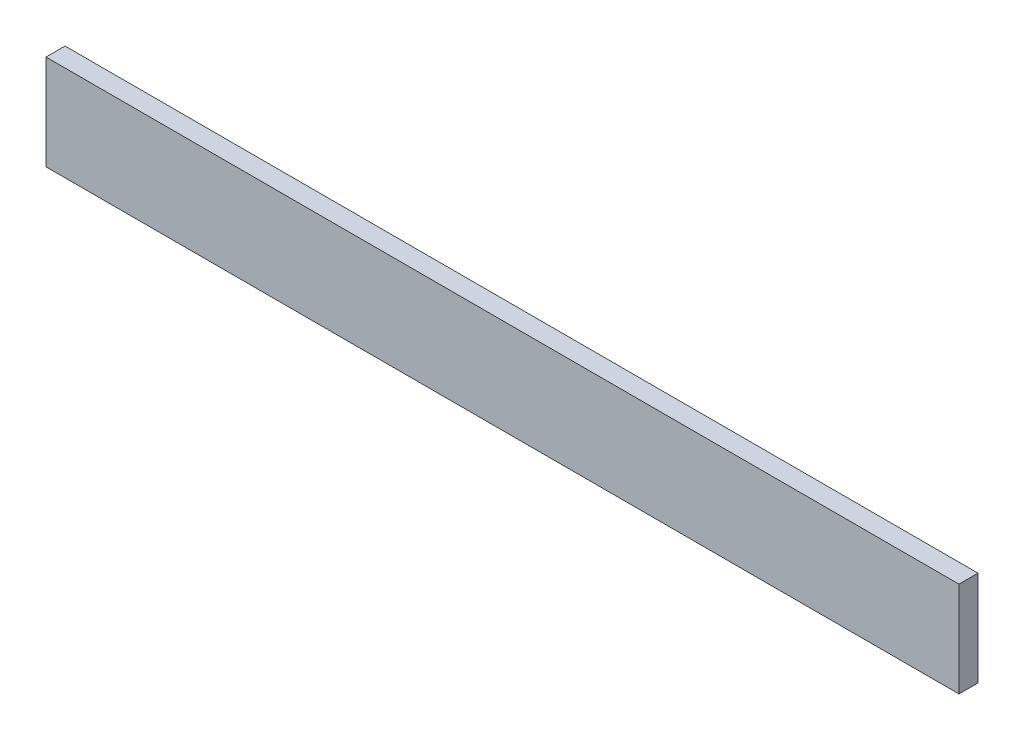
ISO-10303-21;
HEADER;
FILE_DESCRIPTION(('STEP AP214'),'2;1');
FILE_NAME('part.step','',(''),(''),'','','');
FILE_SCHEMA(('AUTOMOTIVE_DESIGN { 1 0 10303 214 1 1 1 1 }'));
ENDSEC;
DATA;
#1=APPLICATION_CONTEXT('core data for automotive mechanical design processes');
#2=APPLICATION_PROTOCOL_DEFINITION('international standard','automotive_design',2000,#1);
#3=PRODUCT_CONTEXT('',#1,'mechanical');
#4=PRODUCT('Part','Part','',(#3));
#5=PRODUCT_RELATED_PRODUCT_CATEGORY('part','',(#4));
#6=PRODUCT_DEFINITION_FORMATION('','',#4);
#7=PRODUCT_DEFINITION_CONTEXT('part definition',#1,'design');
#8=PRODUCT_DEFINITION('design','',#6,#7);
#9=PRODUCT_DEFINITION_SHAPE('','',#8);
#10=(LENGTH_UNIT() NAMED_UNIT(*) SI_UNIT(.MILLI.,.METRE.));
#11=(NAMED_UNIT(*) PLANE_ANGLE_UNIT() SI_UNIT($,.RADIAN.));
#12=(NAMED_UNIT(*) SI_UNIT($,.STERADIAN.) SOLID_ANGLE_UNIT());
#13=UNCERTAINTY_MEASURE_WITH_UNIT(LENGTH_MEASURE(1.E-05),#10,'distance_accuracy_value','');
#14=(GEOMETRIC_REPRESENTATION_CONTEXT(3) GLOBAL_UNCERTAINTY_ASSIGNED_CONTEXT((#13)) GLOBAL_UNIT_ASSIGNED_CONTEXT((#10,
#11,#12)) REPRESENTATION_CONTEXT('',''));
#15=CARTESIAN_POINT('',(0.,0.,0.));
#16=DIRECTION('',(0.,0.,1.));
#17=DIRECTION('',(1.,0.,0.));
#18=AXIS2_PLACEMENT_3D('',#15,#16,#17);
#19=CARTESIAN_POINT('',(304.8,-31.75,12.7));
#20=DIRECTION('',(-1.,0.,0.));
#21=DIRECTION('',(0.,0.,1.));
#22=AXIS2_PLACEMENT_3D('',#19,#20,#21);
#23=PLANE('',#22);
#24=DIRECTION('',(0.,1.,0.));
#25=VECTOR('',#24,1.);
#26=CARTESIAN_POINT('',(304.8,-31.75,0.));
#27=LINE('',#26,#25);
#28=CARTESIAN_POINT('',(304.8,-31.75,0.));
#29=VERTEX_POINT('',#28);
#30=CARTESIAN_POINT('',(304.8,31.75,0.));
#31=VERTEX_POINT('',#30);
#32=EDGE_CURVE('E96',#29,#31,#27,.T.);
#33=ORIENTED_EDGE('',*,*,#32,.T.);
#34=DIRECTION('',(0.,0.,-1.));
#35=VECTOR('',#34,1.);
#36=CARTESIAN_POINT('',(304.8,31.75,12.7));
#37=LINE('',#36,#35);
#38=CARTESIAN_POINT('',(304.8,31.75,12.7));
#39=VERTEX_POINT('',#38);
#40=EDGE_CURVE('E11',#39,#31,#37,.T.);
#41=ORIENTED_EDGE('',*,*,#40,.F.);
#42=DIRECTION('',(0.,1.,0.));
#43=VECTOR('',#42,1.);
#44=CARTESIAN_POINT('',(304.8,-31.75,12.7));
#45=LINE('',#44,#43);
#46=CARTESIAN_POINT('',(304.8,-31.75,12.7));
#47=VERTEX_POINT('',#46);
#48=EDGE_CURVE('E84',#47,#39,#45,.T.);
#49=ORIENTED_EDGE('',*,*,#48,.F.);
#50=DIRECTION('',(0.,0.,-1.));
#51=VECTOR('',#50,1.);
#52=CARTESIAN_POINT('',(304.8,-31.75,12.7));
#53=LINE('',#52,#51);
#54=EDGE_CURVE('E92',#47,#29,#53,.T.);
#55=ORIENTED_EDGE('',*,*,#54,.T.);
#56=EDGE_LOOP('',(#33,#41,#49,#55));
#57=FACE_BOUND('',#56,.T.);
#58=ADVANCED_FACE('F33',(#57),#23,.F.);
#59=CARTESIAN_POINT('',(-304.8,31.75,12.7));
#60=DIRECTION('',(0.,-1.,0.));
#61=DIRECTION('',(0.,0.,-1.));
#62=AXIS2_PLACEMENT_3D('',#59,#60,#61);
#63=PLANE('',#62);
#64=DIRECTION('',(-1.,0.,0.));
#65=VECTOR('',#64,1.);
#66=CARTESIAN_POINT('',(-304.8,31.75,0.));
#67=LINE('',#66,#65);
#68=CARTESIAN_POINT('',(-304.8,31.75,0.));
#69=VERTEX_POINT('',#68);
#70=EDGE_CURVE('E88',#31,#69,#67,.T.);
#71=ORIENTED_EDGE('',*,*,#70,.T.);
#72=DIRECTION('',(0.,0.,-1.));
#73=VECTOR('',#72,1.);
#74=CARTESIAN_POINT('',(-304.8,31.75,12.7));
#75=LINE('',#74,#73);
#76=CARTESIAN_POINT('',(-304.8,31.75,12.7));
#77=VERTEX_POINT('',#76);
#78=EDGE_CURVE('E41',#77,#69,#75,.T.);
#79=ORIENTED_EDGE('',*,*,#78,.F.);
#80=DIRECTION('',(-1.,0.,0.));
#81=VECTOR('',#80,1.);
#82=CARTESIAN_POINT('',(-304.8,31.75,12.7));
#83=LINE('',#82,#81);
#84=EDGE_CURVE('E79',#39,#77,#83,.T.);
#85=ORIENTED_EDGE('',*,*,#84,.F.);
#86=ORIENTED_EDGE('',*,*,#40,.T.);
#87=EDGE_LOOP('',(#71,#79,#85,#86));
#88=FACE_BOUND('',#87,.T.);
#89=ADVANCED_FACE('F87',(#88),#63,.F.);
#90=CARTESIAN_POINT('',(-304.8,-31.75,12.7));
#91=DIRECTION('',(1.,0.,0.));
#92=DIRECTION('',(0.,0.,-1.));
#93=AXIS2_PLACEMENT_3D('',#90,#91,#92);
#94=PLANE('',#93);
#95=DIRECTION('',(0.,-1.,0.));
#96=VECTOR('',#95,1.);
#97=CARTESIAN_POINT('',(-304.8,-31.75,0.));
#98=LINE('',#97,#96);
#99=CARTESIAN_POINT('',(-304.8,-31.75,0.));
#100=VERTEX_POINT('',#99);
#101=EDGE_CURVE('E66',#69,#100,#98,.T.);
#102=ORIENTED_EDGE('',*,*,#101,.T.);
#103=DIRECTION('',(0.,0.,-1.));
#104=VECTOR('',#103,1.);
#105=CARTESIAN_POINT('',(-304.8,-31.75,12.7));
#106=LINE('',#105,#104);
#107=CARTESIAN_POINT('',(-304.8,-31.75,12.7));
#108=VERTEX_POINT('',#107);
#109=EDGE_CURVE('E89',#108,#100,#106,.T.);
#110=ORIENTED_EDGE('',*,*,#109,.F.);
#111=DIRECTION('',(0.,-1.,0.));
#112=VECTOR('',#111,1.);
#113=CARTESIAN_POINT('',(-304.8,-31.75,12.7));
#114=LINE('',#113,#112);
#115=EDGE_CURVE('E82',#77,#108,#114,.T.);
#116=ORIENTED_EDGE('',*,*,#115,.F.);
#117=ORIENTED_EDGE('',*,*,#78,.T.);
#118=EDGE_LOOP('',(#102,#110,#116,#117));
#119=FACE_BOUND('',#118,.T.);
#120=ADVANCED_FACE('F90',(#119),#94,.F.);
#121=CARTESIAN_POINT('',(-304.8,-31.75,12.7));
#122=DIRECTION('',(0.,1.,0.));
#123=DIRECTION('',(0.,0.,1.));
#124=AXIS2_PLACEMENT_3D('',#121,#122,#123);
#125=PLANE('',#124);
#126=DIRECTION('',(1.,0.,0.));
#127=VECTOR('',#126,1.);
#128=CARTESIAN_POINT('',(-304.8,-31.75,0.));
#129=LINE('',#128,#127);
#130=EDGE_CURVE('E72',#100,#29,#129,.T.);
#131=ORIENTED_EDGE('',*,*,#130,.T.);
#132=ORIENTED_EDGE('',*,*,#54,.F.);
#133=DIRECTION('',(1.,0.,0.));
#134=VECTOR('',#133,1.);
#135=CARTESIAN_POINT('',(-304.8,-31.75,12.7));
#136=LINE('',#135,#134);
#137=EDGE_CURVE('E49',#108,#47,#136,.T.);
#138=ORIENTED_EDGE('',*,*,#137,.F.);
#139=ORIENTED_EDGE('',*,*,#109,.T.);
#140=EDGE_LOOP('',(#131,#132,#138,#139));
#141=FACE_BOUND('',#140,.T.);
#142=ADVANCED_FACE('F103',(#141),#125,.F.);
#143=CARTESIAN_POINT('',(0.,0.,12.7));
#144=DIRECTION('',(0.,0.,-1.));
#145=DIRECTION('',(-1.,0.,0.));
#146=AXIS2_PLACEMENT_3D('',#143,#144,#145);
#147=PLANE('',#146);
#148=ORIENTED_EDGE('',*,*,#48,.T.);
#149=ORIENTED_EDGE('',*,*,#84,.T.);
#150=ORIENTED_EDGE('',*,*,#115,.T.);
#151=ORIENTED_EDGE('',*,*,#137,.T.);
#152=EDGE_LOOP('',(#148,#149,#150,#151));
#153=FACE_BOUND('',#152,.T.);
#154=ADVANCED_FACE('F80',(#153),#147,.F.);
#155=CARTESIAN_POINT('',(0.,0.,0.));
#156=DIRECTION('',(0.,0.,-1.));
#157=DIRECTION('',(-1.,0.,0.));
#158=AXIS2_PLACEMENT_3D('',#155,#156,#157);
#159=PLANE('',#158);
#160=ORIENTED_EDGE('',*,*,#32,.F.);
#161=ORIENTED_EDGE('',*,*,#130,.F.);
#162=ORIENTED_EDGE('',*,*,#101,.F.);
#163=ORIENTED_EDGE('',*,*,#70,.F.);
#164=EDGE_LOOP('',(#160,#161,#162,#163));
#165=FACE_BOUND('',#164,.T.);
#166=ADVANCED_FACE('F106',(#165),#159,.T.);
#167=CLOSED_SHELL('',(#58,#89,#120,#142,#154,#166));
#168=MANIFOLD_SOLID_BREP('B2',#167);
#169=ADVANCED_BREP_SHAPE_REPRESENTATION('',(#18,#168),#14);
#170=SHAPE_DEFINITION_REPRESENTATION(#9,#169);
ENDSEC;
END-ISO-10303-21;
